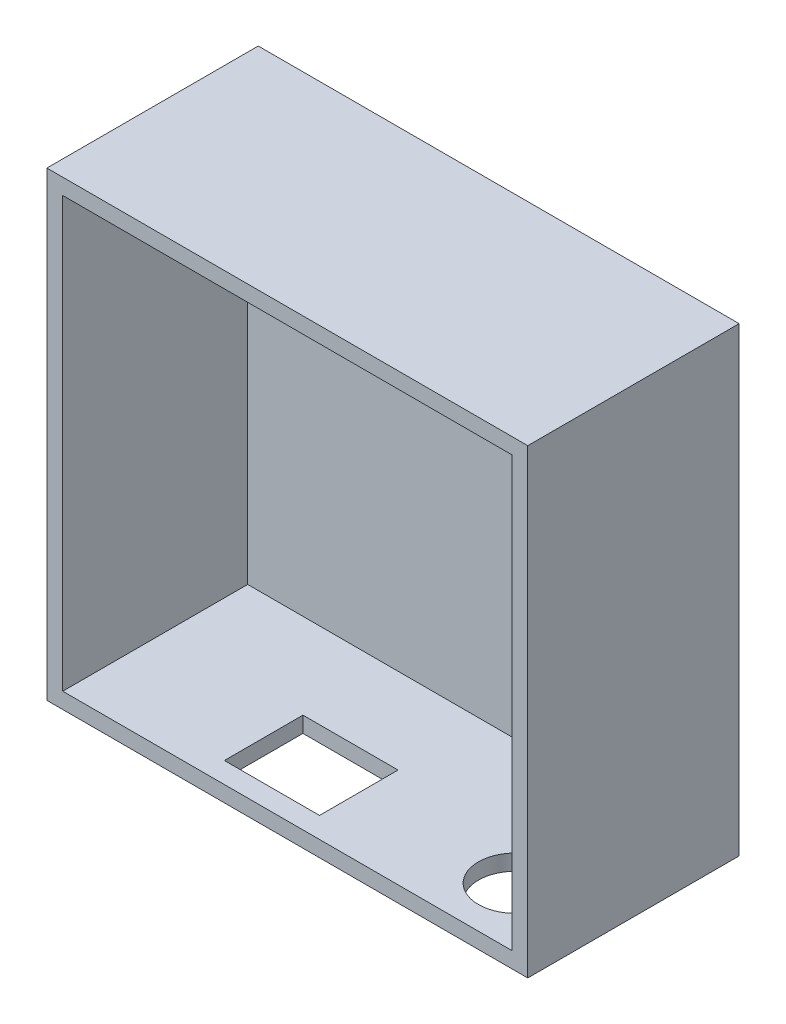
ISO-10303-21;
HEADER;
FILE_DESCRIPTION(('STEP AP214'),'2;1');
FILE_NAME('part.step','',(''),(''),'','','');
FILE_SCHEMA(('AUTOMOTIVE_DESIGN { 1 0 10303 214 1 1 1 1 }'));
ENDSEC;
DATA;
#1=APPLICATION_CONTEXT('core data for automotive mechanical design processes');
#2=APPLICATION_PROTOCOL_DEFINITION('international standard','automotive_design',2000,#1);
#3=PRODUCT_CONTEXT('',#1,'mechanical');
#4=PRODUCT('Part','Part','',(#3));
#5=PRODUCT_RELATED_PRODUCT_CATEGORY('part','',(#4));
#6=PRODUCT_DEFINITION_FORMATION('','',#4);
#7=PRODUCT_DEFINITION_CONTEXT('part definition',#1,'design');
#8=PRODUCT_DEFINITION('design','',#6,#7);
#9=PRODUCT_DEFINITION_SHAPE('','',#8);
#10=(LENGTH_UNIT() NAMED_UNIT(*) SI_UNIT(.MILLI.,.METRE.));
#11=(NAMED_UNIT(*) PLANE_ANGLE_UNIT() SI_UNIT($,.RADIAN.));
#12=(NAMED_UNIT(*) SI_UNIT($,.STERADIAN.) SOLID_ANGLE_UNIT());
#13=UNCERTAINTY_MEASURE_WITH_UNIT(LENGTH_MEASURE(1.E-05),#10,'distance_accuracy_value','');
#14=(GEOMETRIC_REPRESENTATION_CONTEXT(3) GLOBAL_UNCERTAINTY_ASSIGNED_CONTEXT((#13)) GLOBAL_UNIT_ASSIGNED_CONTEXT((#10,
#11,#12)) REPRESENTATION_CONTEXT('',''));
#15=CARTESIAN_POINT('',(0.,0.,0.));
#16=DIRECTION('',(0.,0.,1.));
#17=DIRECTION('',(1.,0.,0.));
#18=AXIS2_PLACEMENT_3D('',#15,#16,#17);
#19=CARTESIAN_POINT('',(0.,0.,35.));
#20=DIRECTION('',(0.,0.,1.));
#21=DIRECTION('',(1.,0.,0.));
#22=AXIS2_PLACEMENT_3D('',#19,#20,#21);
#23=PLANE('',#22);
#24=DIRECTION('',(0.,-1.,0.));
#25=VECTOR('',#24,1.);
#26=CARTESIAN_POINT('',(-5.18353691573431,82.199996948242,35.));
#27=LINE('',#26,#25);
#28=CARTESIAN_POINT('',(-5.18353691573431,82.199996948242,35.));
#29=VERTEX_POINT('',#28);
#30=CARTESIAN_POINT('',(-5.1835369157343,-5.04429616297652,35.));
#31=VERTEX_POINT('',#30);
#32=EDGE_CURVE('E186',#29,#31,#27,.T.);
#33=ORIENTED_EDGE('',*,*,#32,.T.);
#34=DIRECTION('',(1.,0.,0.));
#35=VECTOR('',#34,1.);
#36=CARTESIAN_POINT('',(-5.1835369157343,-5.04429616297652,35.));
#37=LINE('',#36,#35);
#38=CARTESIAN_POINT('',(85.8164630842657,-5.04429616297652,35.));
#39=VERTEX_POINT('',#38);
#40=EDGE_CURVE('E189',#31,#39,#37,.T.);
#41=ORIENTED_EDGE('',*,*,#40,.T.);
#42=DIRECTION('',(0.,1.,0.));
#43=VECTOR('',#42,1.);
#44=CARTESIAN_POINT('',(85.8164630842657,82.199996948242,35.));
#45=LINE('',#44,#43);
#46=CARTESIAN_POINT('',(85.8164630842657,82.199996948242,35.));
#47=VERTEX_POINT('',#46);
#48=EDGE_CURVE('E192',#39,#47,#45,.T.);
#49=ORIENTED_EDGE('',*,*,#48,.T.);
#50=DIRECTION('',(-1.,0.,0.));
#51=VECTOR('',#50,1.);
#52=CARTESIAN_POINT('',(-5.18353691573431,82.199996948242,35.));
#53=LINE('',#52,#51);
#54=EDGE_CURVE('E195',#47,#29,#53,.T.);
#55=ORIENTED_EDGE('',*,*,#54,.T.);
#56=EDGE_LOOP('',(#33,#41,#49,#55));
#57=FACE_BOUND('',#56,.T.);
#58=DIRECTION('',(-1.,0.,0.));
#59=VECTOR('',#58,1.);
#60=CARTESIAN_POINT('',(0.,-2.04429616297653,35.));
#61=LINE('',#60,#59);
#62=CARTESIAN_POINT('',(82.8164630842657,-2.04429616297653,35.));
#63=VERTEX_POINT('',#62);
#64=CARTESIAN_POINT('',(-2.1835369157343,-2.04429616297653,35.));
#65=VERTEX_POINT('',#64);
#66=EDGE_CURVE('E43',#63,#65,#61,.T.);
#67=ORIENTED_EDGE('',*,*,#66,.T.);
#68=DIRECTION('',(0.,1.,0.));
#69=VECTOR('',#68,1.);
#70=CARTESIAN_POINT('',(-2.1835369157343,0.,35.));
#71=LINE('',#70,#69);
#72=CARTESIAN_POINT('',(-2.18353691573431,79.199996948242,35.));
#73=VERTEX_POINT('',#72);
#74=EDGE_CURVE('E11',#65,#73,#71,.T.);
#75=ORIENTED_EDGE('',*,*,#74,.T.);
#76=DIRECTION('',(1.,0.,0.));
#77=VECTOR('',#76,1.);
#78=CARTESIAN_POINT('',(0.,79.199996948242,35.));
#79=LINE('',#78,#77);
#80=CARTESIAN_POINT('',(82.8164630842657,79.199996948242,35.));
#81=VERTEX_POINT('',#80);
#82=EDGE_CURVE('E213',#73,#81,#79,.T.);
#83=ORIENTED_EDGE('',*,*,#82,.T.);
#84=DIRECTION('',(0.,-1.,0.));
#85=VECTOR('',#84,1.);
#86=CARTESIAN_POINT('',(82.8164630842657,0.,35.));
#87=LINE('',#86,#85);
#88=EDGE_CURVE('E221',#81,#63,#87,.T.);
#89=ORIENTED_EDGE('',*,*,#88,.T.);
#90=EDGE_LOOP('',(#67,#75,#83,#89));
#91=FACE_BOUND('',#90,.T.);
#92=ADVANCED_FACE('F35',(#57,#91),#23,.T.);
#93=CARTESIAN_POINT('',(-5.18353691573431,82.199996948242,-5.));
#94=DIRECTION('',(-1.,0.,0.));
#95=DIRECTION('',(0.,-1.,0.));
#96=AXIS2_PLACEMENT_3D('',#93,#94,#95);
#97=PLANE('',#96);
#98=DIRECTION('',(0.,0.,1.));
#99=VECTOR('',#98,1.);
#100=CARTESIAN_POINT('',(-5.1835369157343,-5.04429616297652,-5.));
#101=LINE('',#100,#99);
#102=CARTESIAN_POINT('',(-5.1835369157343,-5.04429616297652,-5.));
#103=VERTEX_POINT('',#102);
#104=EDGE_CURVE('E210',#103,#31,#101,.T.);
#105=ORIENTED_EDGE('',*,*,#104,.T.);
#106=ORIENTED_EDGE('',*,*,#32,.F.);
#107=DIRECTION('',(0.,0.,1.));
#108=VECTOR('',#107,1.);
#109=CARTESIAN_POINT('',(-5.18353691573431,82.199996948242,-5.));
#110=LINE('',#109,#108);
#111=CARTESIAN_POINT('',(-5.18353691573431,82.199996948242,-5.));
#112=VERTEX_POINT('',#111);
#113=EDGE_CURVE('E211',#112,#29,#110,.T.);
#114=ORIENTED_EDGE('',*,*,#113,.F.);
#115=DIRECTION('',(0.,-1.,0.));
#116=VECTOR('',#115,1.);
#117=CARTESIAN_POINT('',(-5.18353691573431,82.199996948242,-5.));
#118=LINE('',#117,#116);
#119=EDGE_CURVE('E198',#112,#103,#118,.T.);
#120=ORIENTED_EDGE('',*,*,#119,.T.);
#121=EDGE_LOOP('',(#105,#106,#114,#120));
#122=FACE_BOUND('',#121,.T.);
#123=ADVANCED_FACE('F37',(#122),#97,.T.);
#124=CARTESIAN_POINT('',(-5.18353691573431,82.199996948242,-5.));
#125=DIRECTION('',(0.,1.,0.));
#126=DIRECTION('',(0.,0.,1.));
#127=AXIS2_PLACEMENT_3D('',#124,#125,#126);
#128=PLANE('',#127);
#129=ORIENTED_EDGE('',*,*,#113,.T.);
#130=ORIENTED_EDGE('',*,*,#54,.F.);
#131=DIRECTION('',(0.,0.,1.));
#132=VECTOR('',#131,1.);
#133=CARTESIAN_POINT('',(85.8164630842657,82.199996948242,-5.));
#134=LINE('',#133,#132);
#135=CARTESIAN_POINT('',(85.8164630842657,82.199996948242,-5.));
#136=VERTEX_POINT('',#135);
#137=EDGE_CURVE('E214',#136,#47,#134,.T.);
#138=ORIENTED_EDGE('',*,*,#137,.F.);
#139=DIRECTION('',(-1.,0.,0.));
#140=VECTOR('',#139,1.);
#141=CARTESIAN_POINT('',(-5.18353691573431,82.199996948242,-5.));
#142=LINE('',#141,#140);
#143=EDGE_CURVE('E207',#136,#112,#142,.T.);
#144=ORIENTED_EDGE('',*,*,#143,.T.);
#145=EDGE_LOOP('',(#129,#130,#138,#144));
#146=FACE_BOUND('',#145,.T.);
#147=ADVANCED_FACE('F260',(#146),#128,.T.);
#148=CARTESIAN_POINT('',(85.8164630842657,82.199996948242,-5.));
#149=DIRECTION('',(1.,0.,0.));
#150=DIRECTION('',(0.,1.,0.));
#151=AXIS2_PLACEMENT_3D('',#148,#149,#150);
#152=PLANE('',#151);
#153=ORIENTED_EDGE('',*,*,#137,.T.);
#154=ORIENTED_EDGE('',*,*,#48,.F.);
#155=DIRECTION('',(0.,0.,1.));
#156=VECTOR('',#155,1.);
#157=CARTESIAN_POINT('',(85.8164630842657,-5.04429616297652,-5.));
#158=LINE('',#157,#156);
#159=CARTESIAN_POINT('',(85.8164630842657,-5.04429616297652,-5.));
#160=VERTEX_POINT('',#159);
#161=EDGE_CURVE('E216',#160,#39,#158,.T.);
#162=ORIENTED_EDGE('',*,*,#161,.F.);
#163=DIRECTION('',(0.,1.,0.));
#164=VECTOR('',#163,1.);
#165=CARTESIAN_POINT('',(85.8164630842657,82.199996948242,-5.));
#166=LINE('',#165,#164);
#167=EDGE_CURVE('E204',#160,#136,#166,.T.);
#168=ORIENTED_EDGE('',*,*,#167,.T.);
#169=EDGE_LOOP('',(#153,#154,#162,#168));
#170=FACE_BOUND('',#169,.T.);
#171=ADVANCED_FACE('F265',(#170),#152,.T.);
#172=CARTESIAN_POINT('',(-5.1835369157343,-5.04429616297652,-5.));
#173=DIRECTION('',(0.,-1.,0.));
#174=DIRECTION('',(0.,0.,-1.));
#175=AXIS2_PLACEMENT_3D('',#172,#173,#174);
#176=PLANE('',#175);
#177=DIRECTION('',(0.,0.,1.));
#178=VECTOR('',#177,1.);
#179=CARTESIAN_POINT('',(42.4640054249547,-5.04429616297652,16.18852));
#180=LINE('',#179,#178);
#181=CARTESIAN_POINT('',(42.4640054249547,-5.04429616297652,16.18852));
#182=VERTEX_POINT('',#181);
#183=CARTESIAN_POINT('',(42.4640054249547,-5.04429616297652,31.05852));
#184=VERTEX_POINT('',#183);
#185=EDGE_CURVE('E50',#182,#184,#180,.T.);
#186=ORIENTED_EDGE('',*,*,#185,.F.);
#187=DIRECTION('',(1.,0.,0.));
#188=VECTOR('',#187,1.);
#189=CARTESIAN_POINT('',(24.464005424955,-5.04429616297652,16.18852));
#190=LINE('',#189,#188);
#191=CARTESIAN_POINT('',(24.464005424955,-5.04429616297652,16.18852));
#192=VERTEX_POINT('',#191);
#193=EDGE_CURVE('E134',#192,#182,#190,.T.);
#194=ORIENTED_EDGE('',*,*,#193,.F.);
#195=DIRECTION('',(0.,0.,-1.));
#196=VECTOR('',#195,1.);
#197=CARTESIAN_POINT('',(24.464005424955,-5.04429616297652,16.18852));
#198=LINE('',#197,#196);
#199=CARTESIAN_POINT('',(24.464005424955,-5.04429616297652,31.05852));
#200=VERTEX_POINT('',#199);
#201=EDGE_CURVE('E142',#200,#192,#198,.T.);
#202=ORIENTED_EDGE('',*,*,#201,.F.);
#203=DIRECTION('',(-1.,0.,0.));
#204=VECTOR('',#203,1.);
#205=CARTESIAN_POINT('',(24.464005424955,-5.04429616297652,31.05852));
#206=LINE('',#205,#204);
#207=EDGE_CURVE('E147',#184,#200,#206,.T.);
#208=ORIENTED_EDGE('',*,*,#207,.F.);
#209=EDGE_LOOP('',(#186,#194,#202,#208));
#210=FACE_BOUND('',#209,.T.);
#211=CARTESIAN_POINT('',(72.1076453410134,-5.04429616297652,23.62352));
#212=DIRECTION('',(0.,-1.,0.));
#213=DIRECTION('',(0.,0.,-1.));
#214=AXIS2_PLACEMENT_3D('',#211,#212,#213);
#215=CIRCLE('',#214,7.);
#216=CARTESIAN_POINT('',(72.1076453410134,-5.04429616297652,16.62352));
#217=VERTEX_POINT('',#216);
#218=EDGE_CURVE('E156',#217,#217,#215,.T.);
#219=ORIENTED_EDGE('',*,*,#218,.F.);
#220=EDGE_LOOP('',(#219));
#221=FACE_BOUND('',#220,.T.);
#222=ORIENTED_EDGE('',*,*,#161,.T.);
#223=ORIENTED_EDGE('',*,*,#40,.F.);
#224=ORIENTED_EDGE('',*,*,#104,.F.);
#225=DIRECTION('',(1.,0.,0.));
#226=VECTOR('',#225,1.);
#227=CARTESIAN_POINT('',(-5.1835369157343,-5.04429616297652,-5.));
#228=LINE('',#227,#226);
#229=EDGE_CURVE('E201',#103,#160,#228,.T.);
#230=ORIENTED_EDGE('',*,*,#229,.T.);
#231=EDGE_LOOP('',(#222,#223,#224,#230));
#232=FACE_BOUND('',#231,.T.);
#233=ADVANCED_FACE('F145',(#210,#221,#232),#176,.T.);
#234=CARTESIAN_POINT('',(0.,0.,-5.));
#235=DIRECTION('',(0.,0.,1.));
#236=DIRECTION('',(1.,0.,0.));
#237=AXIS2_PLACEMENT_3D('',#234,#235,#236);
#238=PLANE('',#237);
#239=ORIENTED_EDGE('',*,*,#119,.F.);
#240=ORIENTED_EDGE('',*,*,#143,.F.);
#241=ORIENTED_EDGE('',*,*,#167,.F.);
#242=ORIENTED_EDGE('',*,*,#229,.F.);
#243=EDGE_LOOP('',(#239,#240,#241,#242));
#244=FACE_BOUND('',#243,.T.);
#245=ADVANCED_FACE('F244',(#244),#238,.F.);
#246=CARTESIAN_POINT('',(-2.18353691573431,79.199996948242,41.));
#247=DIRECTION('',(1.,0.,0.));
#248=DIRECTION('',(0.,1.,0.));
#249=AXIS2_PLACEMENT_3D('',#246,#247,#248);
#250=PLANE('',#249);
#251=DIRECTION('',(0.,0.,-1.));
#252=VECTOR('',#251,1.);
#253=CARTESIAN_POINT('',(-2.1835369157343,-2.04429616297653,41.));
#254=LINE('',#253,#252);
#255=CARTESIAN_POINT('',(-2.1835369157343,-2.04429616297653,0.));
#256=VERTEX_POINT('',#255);
#257=EDGE_CURVE('E184',#65,#256,#254,.T.);
#258=ORIENTED_EDGE('',*,*,#257,.T.);
#259=DIRECTION('',(0.,-1.,0.));
#260=VECTOR('',#259,1.);
#261=CARTESIAN_POINT('',(-2.18353691573431,79.199996948242,0.));
#262=LINE('',#261,#260);
#263=CARTESIAN_POINT('',(-2.18353691573431,79.199996948242,0.));
#264=VERTEX_POINT('',#263);
#265=EDGE_CURVE('E141',#264,#256,#262,.T.);
#266=ORIENTED_EDGE('',*,*,#265,.F.);
#267=DIRECTION('',(0.,0.,-1.));
#268=VECTOR('',#267,1.);
#269=CARTESIAN_POINT('',(-2.18353691573431,79.199996948242,41.));
#270=LINE('',#269,#268);
#271=EDGE_CURVE('E178',#73,#264,#270,.T.);
#272=ORIENTED_EDGE('',*,*,#271,.F.);
#273=ORIENTED_EDGE('',*,*,#74,.F.);
#274=EDGE_LOOP('',(#258,#266,#272,#273));
#275=FACE_BOUND('',#274,.T.);
#276=ADVANCED_FACE('F242',(#275),#250,.T.);
#277=CARTESIAN_POINT('',(-2.1835369157343,-2.04429616297653,41.));
#278=DIRECTION('',(0.,1.,0.));
#279=DIRECTION('',(0.,0.,1.));
#280=AXIS2_PLACEMENT_3D('',#277,#278,#279);
#281=PLANE('',#280);
#282=DIRECTION('',(0.,0.,1.));
#283=VECTOR('',#282,1.);
#284=CARTESIAN_POINT('',(42.4640054249547,-2.04429616297652,16.18852));
#285=LINE('',#284,#283);
#286=CARTESIAN_POINT('',(42.4640054249547,-2.04429616297652,16.18852));
#287=VERTEX_POINT('',#286);
#288=CARTESIAN_POINT('',(42.4640054249547,-2.04429616297652,31.05852));
#289=VERTEX_POINT('',#288);
#290=EDGE_CURVE('E127',#287,#289,#285,.T.);
#291=ORIENTED_EDGE('',*,*,#290,.T.);
#292=DIRECTION('',(-1.,0.,0.));
#293=VECTOR('',#292,1.);
#294=CARTESIAN_POINT('',(24.464005424955,-2.04429616297652,31.05852));
#295=LINE('',#294,#293);
#296=CARTESIAN_POINT('',(24.464005424955,-2.04429616297653,31.05852));
#297=VERTEX_POINT('',#296);
#298=EDGE_CURVE('E150',#289,#297,#295,.T.);
#299=ORIENTED_EDGE('',*,*,#298,.T.);
#300=DIRECTION('',(0.,0.,-1.));
#301=VECTOR('',#300,1.);
#302=CARTESIAN_POINT('',(24.464005424955,-2.04429616297652,16.18852));
#303=LINE('',#302,#301);
#304=CARTESIAN_POINT('',(24.464005424955,-2.04429616297652,16.18852));
#305=VERTEX_POINT('',#304);
#306=EDGE_CURVE('E130',#297,#305,#303,.T.);
#307=ORIENTED_EDGE('',*,*,#306,.T.);
#308=DIRECTION('',(1.,0.,0.));
#309=VECTOR('',#308,1.);
#310=CARTESIAN_POINT('',(24.464005424955,-2.04429616297652,16.18852));
#311=LINE('',#310,#309);
#312=EDGE_CURVE('E131',#305,#287,#311,.T.);
#313=ORIENTED_EDGE('',*,*,#312,.T.);
#314=EDGE_LOOP('',(#291,#299,#307,#313));
#315=FACE_BOUND('',#314,.T.);
#316=CARTESIAN_POINT('',(72.1076453410134,-2.04429616297652,23.62352));
#317=DIRECTION('',(0.,1.,0.));
#318=DIRECTION('',(0.,0.,1.));
#319=AXIS2_PLACEMENT_3D('',#316,#317,#318);
#320=CIRCLE('',#319,7.);
#321=CARTESIAN_POINT('',(72.1076453410134,-2.04429616297652,30.62352));
#322=VERTEX_POINT('',#321);
#323=EDGE_CURVE('E162',#322,#322,#320,.F.);
#324=ORIENTED_EDGE('',*,*,#323,.T.);
#325=EDGE_LOOP('',(#324));
#326=FACE_BOUND('',#325,.T.);
#327=DIRECTION('',(0.,0.,-1.));
#328=VECTOR('',#327,1.);
#329=CARTESIAN_POINT('',(82.8164630842657,-2.04429616297653,41.));
#330=LINE('',#329,#328);
#331=CARTESIAN_POINT('',(82.8164630842657,-2.04429616297653,0.));
#332=VERTEX_POINT('',#331);
#333=EDGE_CURVE('E182',#63,#332,#330,.T.);
#334=ORIENTED_EDGE('',*,*,#333,.T.);
#335=DIRECTION('',(1.,0.,0.));
#336=VECTOR('',#335,1.);
#337=CARTESIAN_POINT('',(-2.1835369157343,-2.04429616297653,0.));
#338=LINE('',#337,#336);
#339=EDGE_CURVE('E169',#256,#332,#338,.T.);
#340=ORIENTED_EDGE('',*,*,#339,.F.);
#341=ORIENTED_EDGE('',*,*,#257,.F.);
#342=ORIENTED_EDGE('',*,*,#66,.F.);
#343=EDGE_LOOP('',(#334,#340,#341,#342));
#344=FACE_BOUND('',#343,.T.);
#345=ADVANCED_FACE('F229',(#315,#326,#344),#281,.T.);
#346=CARTESIAN_POINT('',(82.8164630842657,79.199996948242,41.));
#347=DIRECTION('',(-1.,0.,0.));
#348=DIRECTION('',(0.,-1.,0.));
#349=AXIS2_PLACEMENT_3D('',#346,#347,#348);
#350=PLANE('',#349);
#351=DIRECTION('',(0.,0.,-1.));
#352=VECTOR('',#351,1.);
#353=CARTESIAN_POINT('',(82.8164630842657,79.199996948242,41.));
#354=LINE('',#353,#352);
#355=CARTESIAN_POINT('',(82.8164630842657,79.199996948242,0.));
#356=VERTEX_POINT('',#355);
#357=EDGE_CURVE('E180',#81,#356,#354,.T.);
#358=ORIENTED_EDGE('',*,*,#357,.T.);
#359=DIRECTION('',(0.,1.,0.));
#360=VECTOR('',#359,1.);
#361=CARTESIAN_POINT('',(82.8164630842657,79.199996948242,0.));
#362=LINE('',#361,#360);
#363=EDGE_CURVE('E172',#332,#356,#362,.T.);
#364=ORIENTED_EDGE('',*,*,#363,.F.);
#365=ORIENTED_EDGE('',*,*,#333,.F.);
#366=ORIENTED_EDGE('',*,*,#88,.F.);
#367=EDGE_LOOP('',(#358,#364,#365,#366));
#368=FACE_BOUND('',#367,.T.);
#369=ADVANCED_FACE('F233',(#368),#350,.T.);
#370=CARTESIAN_POINT('',(-2.18353691573431,79.199996948242,41.));
#371=DIRECTION('',(0.,-1.,0.));
#372=DIRECTION('',(0.,0.,-1.));
#373=AXIS2_PLACEMENT_3D('',#370,#371,#372);
#374=PLANE('',#373);
#375=ORIENTED_EDGE('',*,*,#271,.T.);
#376=DIRECTION('',(-1.,0.,0.));
#377=VECTOR('',#376,1.);
#378=CARTESIAN_POINT('',(-2.18353691573431,79.199996948242,0.));
#379=LINE('',#378,#377);
#380=EDGE_CURVE('E175',#356,#264,#379,.T.);
#381=ORIENTED_EDGE('',*,*,#380,.F.);
#382=ORIENTED_EDGE('',*,*,#357,.F.);
#383=ORIENTED_EDGE('',*,*,#82,.F.);
#384=EDGE_LOOP('',(#375,#381,#382,#383));
#385=FACE_BOUND('',#384,.T.);
#386=ADVANCED_FACE('F239',(#385),#374,.T.);
#387=CARTESIAN_POINT('',(0.,0.,0.));
#388=DIRECTION('',(0.,0.,1.));
#389=DIRECTION('',(1.,0.,0.));
#390=AXIS2_PLACEMENT_3D('',#387,#388,#389);
#391=PLANE('',#390);
#392=ORIENTED_EDGE('',*,*,#265,.T.);
#393=ORIENTED_EDGE('',*,*,#339,.T.);
#394=ORIENTED_EDGE('',*,*,#363,.T.);
#395=ORIENTED_EDGE('',*,*,#380,.T.);
#396=EDGE_LOOP('',(#392,#393,#394,#395));
#397=FACE_BOUND('',#396,.T.);
#398=ADVANCED_FACE('F236',(#397),#391,.T.);
#399=CARTESIAN_POINT('',(72.1076453410134,82.200996948242,23.62352));
#400=DIRECTION('',(0.,-1.,0.));
#401=DIRECTION('',(0.,0.,-1.));
#402=AXIS2_PLACEMENT_3D('',#399,#400,#401);
#403=CYLINDRICAL_SURFACE('',#402,7.);
#404=ORIENTED_EDGE('',*,*,#323,.F.);
#405=EDGE_LOOP('',(#404));
#406=FACE_BOUND('',#405,.T.);
#407=ORIENTED_EDGE('',*,*,#218,.T.);
#408=EDGE_LOOP('',(#407));
#409=FACE_BOUND('',#408,.T.);
#410=ADVANCED_FACE('F315',(#406,#409),#403,.F.);
#411=CARTESIAN_POINT('',(42.4640054249547,82.200996948242,16.18852));
#412=DIRECTION('',(1.,0.,0.));
#413=DIRECTION('',(0.,0.,-1.));
#414=AXIS2_PLACEMENT_3D('',#411,#412,#413);
#415=PLANE('',#414);
#416=DIRECTION('',(0.,-1.,0.));
#417=VECTOR('',#416,1.);
#418=CARTESIAN_POINT('',(42.4640054249547,82.200996948242,16.18852));
#419=LINE('',#418,#417);
#420=EDGE_CURVE('E123',#287,#182,#419,.T.);
#421=ORIENTED_EDGE('',*,*,#420,.T.);
#422=ORIENTED_EDGE('',*,*,#185,.T.);
#423=DIRECTION('',(0.,-1.,0.));
#424=VECTOR('',#423,1.);
#425=CARTESIAN_POINT('',(42.4640054249547,82.200996948242,31.05852));
#426=LINE('',#425,#424);
#427=EDGE_CURVE('E155',#289,#184,#426,.T.);
#428=ORIENTED_EDGE('',*,*,#427,.F.);
#429=ORIENTED_EDGE('',*,*,#290,.F.);
#430=EDGE_LOOP('',(#421,#422,#428,#429));
#431=FACE_BOUND('',#430,.T.);
#432=ADVANCED_FACE('F125',(#431),#415,.F.);
#433=CARTESIAN_POINT('',(24.464005424955,82.200996948242,16.18852));
#434=DIRECTION('',(0.,0.,-1.));
#435=DIRECTION('',(-1.,0.,0.));
#436=AXIS2_PLACEMENT_3D('',#433,#434,#435);
#437=PLANE('',#436);
#438=DIRECTION('',(0.,-1.,0.));
#439=VECTOR('',#438,1.);
#440=CARTESIAN_POINT('',(24.464005424955,82.200996948242,16.18852));
#441=LINE('',#440,#439);
#442=EDGE_CURVE('E137',#305,#192,#441,.T.);
#443=ORIENTED_EDGE('',*,*,#442,.T.);
#444=ORIENTED_EDGE('',*,*,#193,.T.);
#445=ORIENTED_EDGE('',*,*,#420,.F.);
#446=ORIENTED_EDGE('',*,*,#312,.F.);
#447=EDGE_LOOP('',(#443,#444,#445,#446));
#448=FACE_BOUND('',#447,.T.);
#449=ADVANCED_FACE('F135',(#448),#437,.F.);
#450=CARTESIAN_POINT('',(24.464005424955,82.200996948242,16.18852));
#451=DIRECTION('',(-1.,0.,0.));
#452=DIRECTION('',(0.,0.,1.));
#453=AXIS2_PLACEMENT_3D('',#450,#451,#452);
#454=PLANE('',#453);
#455=DIRECTION('',(0.,-1.,0.));
#456=VECTOR('',#455,1.);
#457=CARTESIAN_POINT('',(24.464005424955,82.200996948242,31.05852));
#458=LINE('',#457,#456);
#459=EDGE_CURVE('E58',#297,#200,#458,.T.);
#460=ORIENTED_EDGE('',*,*,#459,.T.);
#461=ORIENTED_EDGE('',*,*,#201,.T.);
#462=ORIENTED_EDGE('',*,*,#442,.F.);
#463=ORIENTED_EDGE('',*,*,#306,.F.);
#464=EDGE_LOOP('',(#460,#461,#462,#463));
#465=FACE_BOUND('',#464,.T.);
#466=ADVANCED_FACE('F337',(#465),#454,.F.);
#467=CARTESIAN_POINT('',(24.464005424955,82.200996948242,31.05852));
#468=DIRECTION('',(0.,0.,1.));
#469=DIRECTION('',(1.,0.,0.));
#470=AXIS2_PLACEMENT_3D('',#467,#468,#469);
#471=PLANE('',#470);
#472=ORIENTED_EDGE('',*,*,#427,.T.);
#473=ORIENTED_EDGE('',*,*,#207,.T.);
#474=ORIENTED_EDGE('',*,*,#459,.F.);
#475=ORIENTED_EDGE('',*,*,#298,.F.);
#476=EDGE_LOOP('',(#472,#473,#474,#475));
#477=FACE_BOUND('',#476,.T.);
#478=ADVANCED_FACE('F344',(#477),#471,.F.);
#479=CLOSED_SHELL('',(#92,#123,#147,#171,#233,#245,#276,#345,#369,#386,#398,#410,#432,#449,#466,#478));
#480=MANIFOLD_SOLID_BREP('B2',#479);
#481=ADVANCED_BREP_SHAPE_REPRESENTATION('',(#18,#480),#14);
#482=SHAPE_DEFINITION_REPRESENTATION(#9,#481);
ENDSEC;
END-ISO-10303-21;
